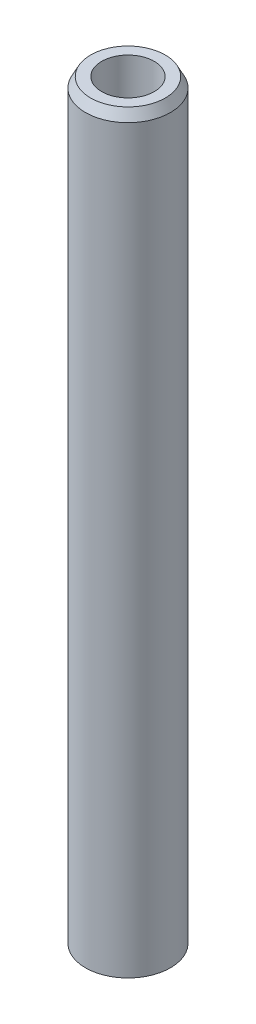
ISO-10303-21;
HEADER;
FILE_DESCRIPTION(('STEP AP214'),'2;1');
FILE_NAME('part.step','',(''),(''),'','','');
FILE_SCHEMA(('AUTOMOTIVE_DESIGN { 1 0 10303 214 1 1 1 1 }'));
ENDSEC;
DATA;
#1=APPLICATION_CONTEXT('core data for automotive mechanical design processes');
#2=APPLICATION_PROTOCOL_DEFINITION('international standard','automotive_design',2000,#1);
#3=PRODUCT_CONTEXT('',#1,'mechanical');
#4=PRODUCT('Part','Part','',(#3));
#5=PRODUCT_RELATED_PRODUCT_CATEGORY('part','',(#4));
#6=PRODUCT_DEFINITION_FORMATION('','',#4);
#7=PRODUCT_DEFINITION_CONTEXT('part definition',#1,'design');
#8=PRODUCT_DEFINITION('design','',#6,#7);
#9=PRODUCT_DEFINITION_SHAPE('','',#8);
#10=(LENGTH_UNIT() NAMED_UNIT(*) SI_UNIT(.MILLI.,.METRE.));
#11=(NAMED_UNIT(*) PLANE_ANGLE_UNIT() SI_UNIT($,.RADIAN.));
#12=(NAMED_UNIT(*) SI_UNIT($,.STERADIAN.) SOLID_ANGLE_UNIT());
#13=UNCERTAINTY_MEASURE_WITH_UNIT(LENGTH_MEASURE(1.E-05),#10,'distance_accuracy_value','');
#14=(GEOMETRIC_REPRESENTATION_CONTEXT(3) GLOBAL_UNCERTAINTY_ASSIGNED_CONTEXT((#13)) GLOBAL_UNIT_ASSIGNED_CONTEXT((#10,
#11,#12)) REPRESENTATION_CONTEXT('',''));
#15=CARTESIAN_POINT('',(0.,0.,0.));
#16=DIRECTION('',(0.,0.,1.));
#17=DIRECTION('',(1.,0.,0.));
#18=AXIS2_PLACEMENT_3D('',#15,#16,#17);
#19=CARTESIAN_POINT('',(0.,177.874236027116,0.));
#20=DIRECTION('',(0.,-1.,0.));
#21=DIRECTION('',(0.,0.,-1.));
#22=AXIS2_PLACEMENT_3D('',#19,#20,#21);
#23=CYLINDRICAL_SURFACE('',#22,10.);
#24=CARTESIAN_POINT('',(0.,175.522527301074,0.));
#25=DIRECTION('',(0.,1.,0.));
#26=DIRECTION('',(0.,0.,1.));
#27=AXIS2_PLACEMENT_3D('',#24,#25,#26);
#28=CIRCLE('',#27,10.);
#29=CARTESIAN_POINT('',(0.,175.522527301074,10.));
#30=VERTEX_POINT('',#29);
#31=EDGE_CURVE('E50',#30,#30,#28,.F.);
#32=ORIENTED_EDGE('',*,*,#31,.T.);
#33=EDGE_LOOP('',(#32));
#34=FACE_BOUND('',#33,.T.);
#35=CARTESIAN_POINT('',(0.,1.21533881377323,0.));
#36=DIRECTION('',(0.,1.,0.));
#37=DIRECTION('',(0.,0.,1.));
#38=AXIS2_PLACEMENT_3D('',#35,#36,#37);
#39=CIRCLE('',#38,10.);
#40=CARTESIAN_POINT('',(0.,1.21533881377323,10.));
#41=VERTEX_POINT('',#40);
#42=EDGE_CURVE('E51',#41,#41,#39,.T.);
#43=ORIENTED_EDGE('',*,*,#42,.T.);
#44=EDGE_LOOP('',(#43));
#45=FACE_BOUND('',#44,.T.);
#46=ADVANCED_FACE('F39',(#34,#45),#23,.T.);
#47=CARTESIAN_POINT('',(0.,177.874236027116,0.));
#48=DIRECTION('',(0.,1.,0.));
#49=DIRECTION('',(0.,0.,1.));
#50=AXIS2_PLACEMENT_3D('',#47,#48,#49);
#51=PLANE('',#50);
#52=CARTESIAN_POINT('',(0.,177.874236027116,0.));
#53=DIRECTION('',(0.,1.,0.));
#54=DIRECTION('',(0.,0.,1.));
#55=AXIS2_PLACEMENT_3D('',#52,#53,#54);
#56=CIRCLE('',#55,8.78466118622678);
#57=CARTESIAN_POINT('',(0.,177.874236027116,8.78466118622678));
#58=VERTEX_POINT('',#57);
#59=EDGE_CURVE('E54',#58,#58,#56,.T.);
#60=ORIENTED_EDGE('',*,*,#59,.T.);
#61=EDGE_LOOP('',(#60));
#62=FACE_BOUND('',#61,.T.);
#63=CARTESIAN_POINT('',(0.,177.874236027116,0.));
#64=DIRECTION('',(0.,1.,0.));
#65=DIRECTION('',(0.,0.,1.));
#66=AXIS2_PLACEMENT_3D('',#63,#64,#65);
#67=CIRCLE('',#66,6.18650940664454);
#68=CARTESIAN_POINT('',(0.,177.874236027116,6.18650940664454));
#69=VERTEX_POINT('',#68);
#70=EDGE_CURVE('E58',#69,#69,#67,.T.);
#71=ORIENTED_EDGE('',*,*,#70,.F.);
#72=EDGE_LOOP('',(#71));
#73=FACE_BOUND('',#72,.T.);
#74=ADVANCED_FACE('F69',(#62,#73),#51,.T.);
#75=CARTESIAN_POINT('',(0.,0.,0.));
#76=DIRECTION('',(0.,1.,0.));
#77=DIRECTION('',(0.,0.,1.));
#78=AXIS2_PLACEMENT_3D('',#75,#76,#77);
#79=PLANE('',#78);
#80=CARTESIAN_POINT('',(0.,0.,0.));
#81=DIRECTION('',(0.,1.,0.));
#82=DIRECTION('',(0.,0.,1.));
#83=AXIS2_PLACEMENT_3D('',#80,#81,#82);
#84=CIRCLE('',#83,7.64829127395886);
#85=CARTESIAN_POINT('',(0.,0.,7.64829127395886));
#86=VERTEX_POINT('',#85);
#87=EDGE_CURVE('E10',#86,#86,#84,.F.);
#88=ORIENTED_EDGE('',*,*,#87,.T.);
#89=EDGE_LOOP('',(#88));
#90=FACE_BOUND('',#89,.T.);
#91=CARTESIAN_POINT('',(0.,0.,0.));
#92=DIRECTION('',(0.,1.,0.));
#93=DIRECTION('',(0.,0.,1.));
#94=AXIS2_PLACEMENT_3D('',#91,#92,#93);
#95=CIRCLE('',#94,6.18650940664454);
#96=CARTESIAN_POINT('',(0.,0.,6.18650940664454));
#97=VERTEX_POINT('',#96);
#98=EDGE_CURVE('E63',#97,#97,#95,.T.);
#99=ORIENTED_EDGE('',*,*,#98,.T.);
#100=EDGE_LOOP('',(#99));
#101=FACE_BOUND('',#100,.T.);
#102=ADVANCED_FACE('F75',(#90,#101),#79,.F.);
#103=CARTESIAN_POINT('',(0.,177.874236027116,0.));
#104=DIRECTION('',(0.,-1.,0.));
#105=DIRECTION('',(0.,0.,-1.));
#106=AXIS2_PLACEMENT_3D('',#103,#104,#105);
#107=CYLINDRICAL_SURFACE('',#106,6.18650940664454);
#108=ORIENTED_EDGE('',*,*,#70,.T.);
#109=EDGE_LOOP('',(#108));
#110=FACE_BOUND('',#109,.T.);
#111=ORIENTED_EDGE('',*,*,#98,.F.);
#112=EDGE_LOOP('',(#111));
#113=FACE_BOUND('',#112,.T.);
#114=ADVANCED_FACE('F70',(#110,#113),#107,.F.);
#115=CARTESIAN_POINT('',(0.,177.874236027116,0.));
#116=DIRECTION('',(0.,-1.,0.));
#117=DIRECTION('',(0.,0.,-1.));
#118=AXIS2_PLACEMENT_3D('',#115,#116,#117);
#119=CONICAL_SURFACE('',#118,8.78466118622678,0.476988961919083);
#120=ORIENTED_EDGE('',*,*,#31,.F.);
#121=EDGE_LOOP('',(#120));
#122=FACE_BOUND('',#121,.T.);
#123=ORIENTED_EDGE('',*,*,#59,.F.);
#124=EDGE_LOOP('',(#123));
#125=FACE_BOUND('',#124,.T.);
#126=ADVANCED_FACE('F81',(#122,#125),#119,.T.);
#127=CARTESIAN_POINT('',(0.,1.21533881377323,0.));
#128=DIRECTION('',(0.,1.,0.));
#129=DIRECTION('',(0.,0.,1.));
#130=AXIS2_PLACEMENT_3D('',#127,#128,#129);
#131=CONICAL_SURFACE('',#130,10.,1.0938073648758);
#132=ORIENTED_EDGE('',*,*,#87,.F.);
#133=EDGE_LOOP('',(#132));
#134=FACE_BOUND('',#133,.T.);
#135=ORIENTED_EDGE('',*,*,#42,.F.);
#136=EDGE_LOOP('',(#135));
#137=FACE_BOUND('',#136,.T.);
#138=ADVANCED_FACE('F45',(#134,#137),#131,.T.);
#139=CLOSED_SHELL('',(#46,#74,#102,#114,#126,#138));
#140=MANIFOLD_SOLID_BREP('B2',#139);
#141=ADVANCED_BREP_SHAPE_REPRESENTATION('',(#18,#140),#14);
#142=SHAPE_DEFINITION_REPRESENTATION(#9,#141);
ENDSEC;
END-ISO-10303-21;
